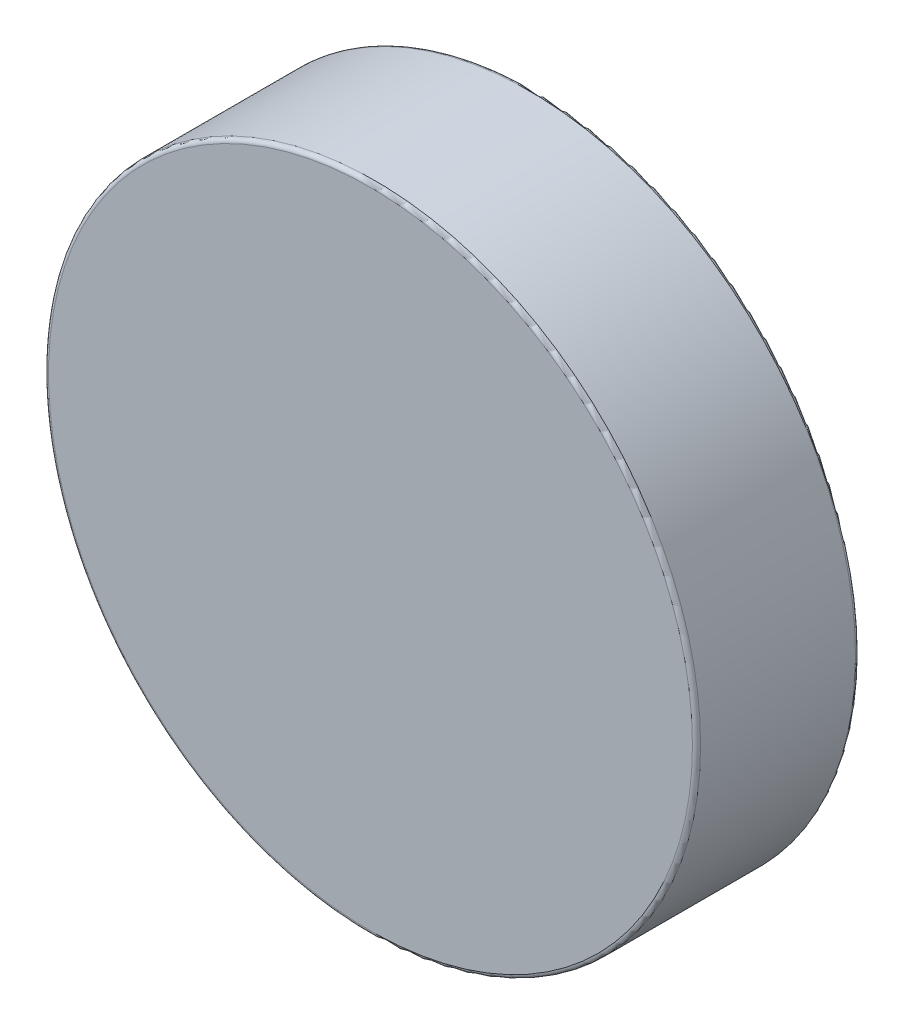
ISO-10303-21;
HEADER;
FILE_DESCRIPTION(('STEP AP214'),'2;1');
FILE_NAME('part.step','',(''),(''),'','','');
FILE_SCHEMA(('AUTOMOTIVE_DESIGN { 1 0 10303 214 1 1 1 1 }'));
ENDSEC;
DATA;
#1=APPLICATION_CONTEXT('core data for automotive mechanical design processes');
#2=APPLICATION_PROTOCOL_DEFINITION('international standard','automotive_design',2000,#1);
#3=PRODUCT_CONTEXT('',#1,'mechanical');
#4=PRODUCT('Part','Part','',(#3));
#5=PRODUCT_RELATED_PRODUCT_CATEGORY('part','',(#4));
#6=PRODUCT_DEFINITION_FORMATION('','',#4);
#7=PRODUCT_DEFINITION_CONTEXT('part definition',#1,'design');
#8=PRODUCT_DEFINITION('design','',#6,#7);
#9=PRODUCT_DEFINITION_SHAPE('','',#8);
#10=(LENGTH_UNIT() NAMED_UNIT(*) SI_UNIT(.MILLI.,.METRE.));
#11=(NAMED_UNIT(*) PLANE_ANGLE_UNIT() SI_UNIT($,.RADIAN.));
#12=(NAMED_UNIT(*) SI_UNIT($,.STERADIAN.) SOLID_ANGLE_UNIT());
#13=UNCERTAINTY_MEASURE_WITH_UNIT(LENGTH_MEASURE(1.E-05),#10,'distance_accuracy_value','');
#14=(GEOMETRIC_REPRESENTATION_CONTEXT(3) GLOBAL_UNCERTAINTY_ASSIGNED_CONTEXT((#13)) GLOBAL_UNIT_ASSIGNED_CONTEXT((#10,
#11,#12)) REPRESENTATION_CONTEXT('',''));
#15=CARTESIAN_POINT('',(0.,0.,0.));
#16=DIRECTION('',(0.,0.,1.));
#17=DIRECTION('',(1.,0.,0.));
#18=AXIS2_PLACEMENT_3D('',#15,#16,#17);
#19=CARTESIAN_POINT('',(0.,0.,0.79375));
#20=DIRECTION('',(0.,0.,-1.));
#21=DIRECTION('',(-1.,0.,0.));
#22=AXIS2_PLACEMENT_3D('',#19,#20,#21);
#23=CYLINDRICAL_SURFACE('',#22,3.175);
#24=CARTESIAN_POINT('',(0.,0.,-0.7540625));
#25=DIRECTION('',(0.,0.,1.));
#26=DIRECTION('',(1.,0.,0.));
#27=AXIS2_PLACEMENT_3D('',#24,#25,#26);
#28=CIRCLE('',#27,3.175);
#29=CARTESIAN_POINT('',(3.175,0.,-0.7540625));
#30=VERTEX_POINT('',#29);
#31=EDGE_CURVE('E44',#30,#30,#28,.T.);
#32=ORIENTED_EDGE('',*,*,#31,.T.);
#33=EDGE_LOOP('',(#32));
#34=FACE_BOUND('',#33,.T.);
#35=CARTESIAN_POINT('',(0.,0.,0.7540625));
#36=DIRECTION('',(0.,0.,1.));
#37=DIRECTION('',(1.,0.,0.));
#38=AXIS2_PLACEMENT_3D('',#35,#36,#37);
#39=CIRCLE('',#38,3.175);
#40=CARTESIAN_POINT('',(3.175,0.,0.7540625));
#41=VERTEX_POINT('',#40);
#42=EDGE_CURVE('E48',#41,#41,#39,.F.);
#43=ORIENTED_EDGE('',*,*,#42,.T.);
#44=EDGE_LOOP('',(#43));
#45=FACE_BOUND('',#44,.T.);
#46=ADVANCED_FACE('F33',(#34,#45),#23,.T.);
#47=CARTESIAN_POINT('',(0.,0.,0.79375));
#48=DIRECTION('',(0.,0.,1.));
#49=DIRECTION('',(1.,0.,0.));
#50=AXIS2_PLACEMENT_3D('',#47,#48,#49);
#51=PLANE('',#50);
#52=CARTESIAN_POINT('',(0.,0.,0.79375));
#53=DIRECTION('',(0.,0.,1.));
#54=DIRECTION('',(1.,0.,0.));
#55=AXIS2_PLACEMENT_3D('',#52,#53,#54);
#56=CIRCLE('',#55,3.1353125);
#57=CARTESIAN_POINT('',(3.1353125,0.,0.79375));
#58=VERTEX_POINT('',#57);
#59=EDGE_CURVE('E10',#58,#58,#56,.T.);
#60=ORIENTED_EDGE('',*,*,#59,.T.);
#61=EDGE_LOOP('',(#60));
#62=FACE_BOUND('',#61,.T.);
#63=ADVANCED_FACE('F64',(#62),#51,.T.);
#64=CARTESIAN_POINT('',(0.,0.,-0.79375));
#65=DIRECTION('',(0.,0.,1.));
#66=DIRECTION('',(1.,0.,0.));
#67=AXIS2_PLACEMENT_3D('',#64,#65,#66);
#68=PLANE('',#67);
#69=CARTESIAN_POINT('',(0.,0.,-0.79375));
#70=DIRECTION('',(0.,0.,1.));
#71=DIRECTION('',(1.,0.,0.));
#72=AXIS2_PLACEMENT_3D('',#69,#70,#71);
#73=CIRCLE('',#72,3.1353125);
#74=CARTESIAN_POINT('',(3.1353125,0.,-0.79375));
#75=VERTEX_POINT('',#74);
#76=EDGE_CURVE('E40',#75,#75,#73,.F.);
#77=ORIENTED_EDGE('',*,*,#76,.T.);
#78=EDGE_LOOP('',(#77));
#79=FACE_BOUND('',#78,.T.);
#80=ADVANCED_FACE('F61',(#79),#68,.F.);
#81=CARTESIAN_POINT('',(0.,0.,-0.7540625));
#82=DIRECTION('',(0.,0.,1.));
#83=DIRECTION('',(1.,0.,0.));
#84=AXIS2_PLACEMENT_3D('',#81,#82,#83);
#85=TOROIDAL_SURFACE('',#84,3.1353125,0.0396875);
#86=ORIENTED_EDGE('',*,*,#76,.F.);
#87=EDGE_LOOP('',(#86));
#88=FACE_BOUND('',#87,.T.);
#89=ORIENTED_EDGE('',*,*,#31,.F.);
#90=EDGE_LOOP('',(#89));
#91=FACE_BOUND('',#90,.T.);
#92=ADVANCED_FACE('F57',(#88,#91),#85,.T.);
#93=CARTESIAN_POINT('',(0.,0.,0.7540625));
#94=DIRECTION('',(0.,0.,1.));
#95=DIRECTION('',(1.,0.,0.));
#96=AXIS2_PLACEMENT_3D('',#93,#94,#95);
#97=TOROIDAL_SURFACE('',#96,3.1353125,0.0396875);
#98=ORIENTED_EDGE('',*,*,#42,.F.);
#99=EDGE_LOOP('',(#98));
#100=FACE_BOUND('',#99,.T.);
#101=ORIENTED_EDGE('',*,*,#59,.F.);
#102=EDGE_LOOP('',(#101));
#103=FACE_BOUND('',#102,.T.);
#104=ADVANCED_FACE('F35',(#100,#103),#97,.T.);
#105=CLOSED_SHELL('',(#46,#63,#80,#92,#104));
#106=MANIFOLD_SOLID_BREP('B2',#105);
#107=ADVANCED_BREP_SHAPE_REPRESENTATION('',(#18,#106),#14);
#108=SHAPE_DEFINITION_REPRESENTATION(#9,#107);
ENDSEC;
END-ISO-10303-21;
